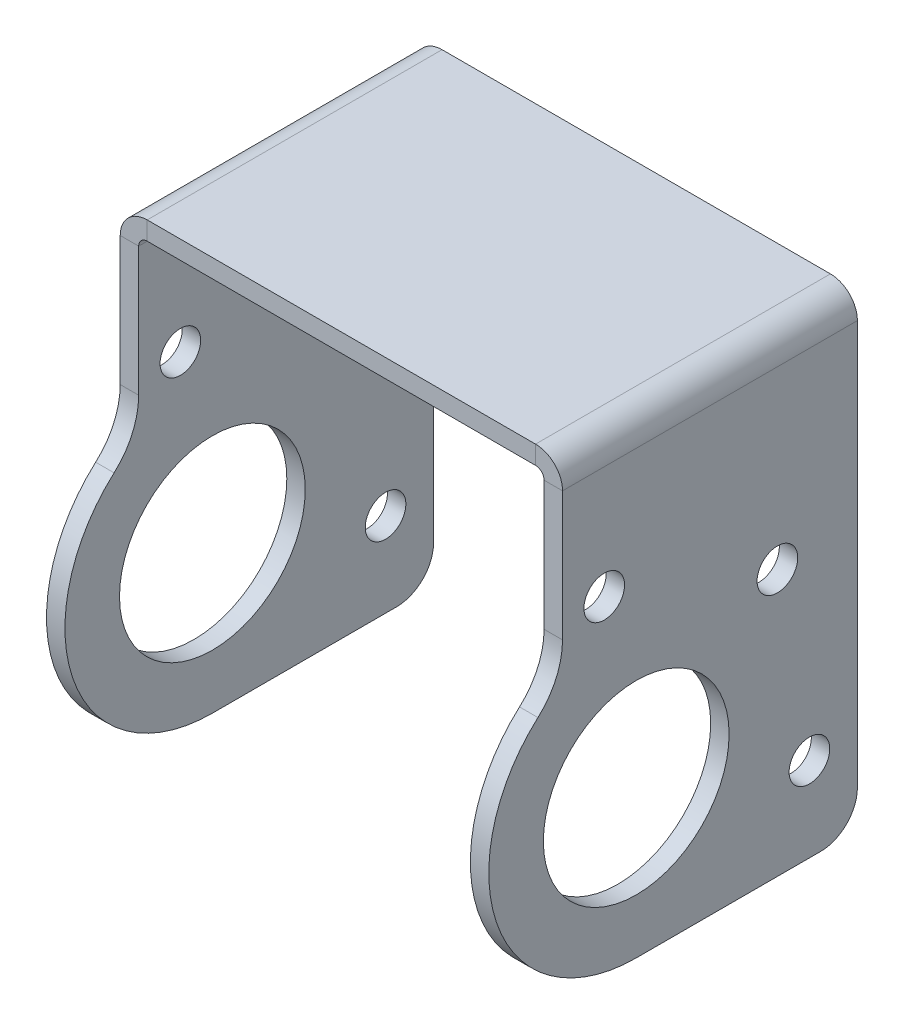
ISO-10303-21;
HEADER;
FILE_DESCRIPTION(('STEP AP214'),'2;1');
FILE_NAME('part.step','',(''),(''),'','','');
FILE_SCHEMA(('AUTOMOTIVE_DESIGN { 1 0 10303 214 1 1 1 1 }'));
ENDSEC;
DATA;
#1=APPLICATION_CONTEXT('core data for automotive mechanical design processes');
#2=APPLICATION_PROTOCOL_DEFINITION('international standard','automotive_design',2000,#1);
#3=PRODUCT_CONTEXT('',#1,'mechanical');
#4=PRODUCT('Part','Part','',(#3));
#5=PRODUCT_RELATED_PRODUCT_CATEGORY('part','',(#4));
#6=PRODUCT_DEFINITION_FORMATION('','',#4);
#7=PRODUCT_DEFINITION_CONTEXT('part definition',#1,'design');
#8=PRODUCT_DEFINITION('design','',#6,#7);
#9=PRODUCT_DEFINITION_SHAPE('','',#8);
#10=(LENGTH_UNIT() NAMED_UNIT(*) SI_UNIT(.MILLI.,.METRE.));
#11=(NAMED_UNIT(*) PLANE_ANGLE_UNIT() SI_UNIT($,.RADIAN.));
#12=(NAMED_UNIT(*) SI_UNIT($,.STERADIAN.) SOLID_ANGLE_UNIT());
#13=UNCERTAINTY_MEASURE_WITH_UNIT(LENGTH_MEASURE(1.E-05),#10,'distance_accuracy_value','');
#14=(GEOMETRIC_REPRESENTATION_CONTEXT(3) GLOBAL_UNCERTAINTY_ASSIGNED_CONTEXT((#13)) GLOBAL_UNIT_ASSIGNED_CONTEXT((#10,
#11,#12)) REPRESENTATION_CONTEXT('',''));
#15=CARTESIAN_POINT('',(0.,0.,0.));
#16=DIRECTION('',(0.,0.,1.));
#17=DIRECTION('',(1.,0.,0.));
#18=AXIS2_PLACEMENT_3D('',#15,#16,#17);
#19=CARTESIAN_POINT('',(-19.05,-1.5875,-12.7));
#20=DIRECTION('',(0.,0.,-1.));
#21=DIRECTION('',(-1.,0.,0.));
#22=AXIS2_PLACEMENT_3D('',#19,#20,#21);
#23=PLANE('',#22);
#24=DIRECTION('',(-1.,0.,0.));
#25=VECTOR('',#24,1.);
#26=CARTESIAN_POINT('',(19.05,-1.5875,-12.7));
#27=LINE('',#26,#25);
#28=CARTESIAN_POINT('',(16.7259,-1.5875,-12.7));
#29=VERTEX_POINT('',#28);
#30=CARTESIAN_POINT('',(-16.7259,-1.5875,-12.7));
#31=VERTEX_POINT('',#30);
#32=EDGE_CURVE('E254',#29,#31,#27,.T.);
#33=ORIENTED_EDGE('',*,*,#32,.T.);
#34=DIRECTION('',(0.,1.,0.));
#35=VECTOR('',#34,1.);
#36=CARTESIAN_POINT('',(-16.7259,-1.5875,-12.7));
#37=LINE('',#36,#35);
#38=CARTESIAN_POINT('',(-16.7259,0.,-12.7));
#39=VERTEX_POINT('',#38);
#40=EDGE_CURVE('E12',#31,#39,#37,.T.);
#41=ORIENTED_EDGE('',*,*,#40,.T.);
#42=DIRECTION('',(-1.,0.,0.));
#43=VECTOR('',#42,1.);
#44=CARTESIAN_POINT('',(-19.05,0.,-12.7));
#45=LINE('',#44,#43);
#46=CARTESIAN_POINT('',(16.7259,0.,-12.7));
#47=VERTEX_POINT('',#46);
#48=EDGE_CURVE('E259',#47,#39,#45,.T.);
#49=ORIENTED_EDGE('',*,*,#48,.F.);
#50=DIRECTION('',(0.,-1.,0.));
#51=VECTOR('',#50,1.);
#52=CARTESIAN_POINT('',(16.7259,-1.5875,-12.7));
#53=LINE('',#52,#51);
#54=EDGE_CURVE('E251',#47,#29,#53,.T.);
#55=ORIENTED_EDGE('',*,*,#54,.T.);
#56=EDGE_LOOP('',(#33,#41,#49,#55));
#57=FACE_BOUND('',#56,.T.);
#58=ADVANCED_FACE('F51',(#57),#23,.T.);
#59=CARTESIAN_POINT('',(0.,-1.5875,12.7));
#60=DIRECTION('',(0.,0.,1.));
#61=DIRECTION('',(1.,0.,0.));
#62=AXIS2_PLACEMENT_3D('',#59,#60,#61);
#63=PLANE('',#62);
#64=DIRECTION('',(1.,0.,0.));
#65=VECTOR('',#64,1.);
#66=CARTESIAN_POINT('',(0.,0.,12.7));
#67=LINE('',#66,#65);
#68=CARTESIAN_POINT('',(-16.7259,0.,12.7));
#69=VERTEX_POINT('',#68);
#70=CARTESIAN_POINT('',(16.7259,0.,12.7));
#71=VERTEX_POINT('',#70);
#72=EDGE_CURVE('E255',#69,#71,#67,.T.);
#73=ORIENTED_EDGE('',*,*,#72,.F.);
#74=DIRECTION('',(0.,-1.,0.));
#75=VECTOR('',#74,1.);
#76=CARTESIAN_POINT('',(-16.7259,-1.5875,12.7));
#77=LINE('',#76,#75);
#78=CARTESIAN_POINT('',(-16.7259,-1.5875,12.7));
#79=VERTEX_POINT('',#78);
#80=EDGE_CURVE('E346',#69,#79,#77,.T.);
#81=ORIENTED_EDGE('',*,*,#80,.T.);
#82=DIRECTION('',(1.,0.,0.));
#83=VECTOR('',#82,1.);
#84=CARTESIAN_POINT('',(19.05,-1.5875,12.7));
#85=LINE('',#84,#83);
#86=CARTESIAN_POINT('',(16.7259,-1.5875,12.7));
#87=VERTEX_POINT('',#86);
#88=EDGE_CURVE('E54',#79,#87,#85,.T.);
#89=ORIENTED_EDGE('',*,*,#88,.T.);
#90=DIRECTION('',(0.,1.,0.));
#91=VECTOR('',#90,1.);
#92=CARTESIAN_POINT('',(16.7259,-1.5875,12.7));
#93=LINE('',#92,#91);
#94=EDGE_CURVE('E256',#87,#71,#93,.T.);
#95=ORIENTED_EDGE('',*,*,#94,.T.);
#96=EDGE_LOOP('',(#73,#81,#89,#95));
#97=FACE_BOUND('',#96,.T.);
#98=ADVANCED_FACE('F368',(#97),#63,.T.);
#99=CARTESIAN_POINT('',(30.2509683428763,-1.5875,19.05));
#100=DIRECTION('',(0.,-1.,0.));
#101=DIRECTION('',(0.,0.,-1.));
#102=AXIS2_PLACEMENT_3D('',#99,#100,#101);
#103=PLANE('',#102);
#104=ORIENTED_EDGE('',*,*,#88,.F.);
#105=DIRECTION('',(0.,0.,-1.));
#106=VECTOR('',#105,1.);
#107=CARTESIAN_POINT('',(-16.7259,-1.5875,19.05));
#108=LINE('',#107,#106);
#109=EDGE_CURVE('E337',#79,#31,#108,.T.);
#110=ORIENTED_EDGE('',*,*,#109,.T.);
#111=ORIENTED_EDGE('',*,*,#32,.F.);
#112=DIRECTION('',(0.,0.,1.));
#113=VECTOR('',#112,1.);
#114=CARTESIAN_POINT('',(16.7259,-1.5875,19.05));
#115=LINE('',#114,#113);
#116=EDGE_CURVE('E260',#29,#87,#115,.T.);
#117=ORIENTED_EDGE('',*,*,#116,.T.);
#118=EDGE_LOOP('',(#104,#110,#111,#117));
#119=FACE_BOUND('',#118,.T.);
#120=ADVANCED_FACE('F371',(#119),#103,.T.);
#121=CARTESIAN_POINT('',(19.05,-13.4453001841658,19.05));
#122=DIRECTION('',(-1.,0.,0.));
#123=DIRECTION('',(0.,0.,-1.));
#124=AXIS2_PLACEMENT_3D('',#121,#122,#123);
#125=PLANE('',#124);
#126=CARTESIAN_POINT('',(19.0499999999999,-27.6443318412894,6.35));
#127=DIRECTION('',(1.,0.,0.));
#128=DIRECTION('',(0.,0.,1.));
#129=AXIS2_PLACEMENT_3D('',#126,#127,#128);
#130=CIRCLE('',#129,7.99999999999999);
#131=CARTESIAN_POINT('',(19.0499999999999,-27.6443318412894,14.35));
#132=VERTEX_POINT('',#131);
#133=EDGE_CURVE('E281',#132,#132,#130,.T.);
#134=ORIENTED_EDGE('',*,*,#133,.F.);
#135=EDGE_LOOP('',(#134));
#136=FACE_BOUND('',#135,.T.);
#137=CARTESIAN_POINT('',(19.05,-12.0105087622206,9.10666482046241));
#138=DIRECTION('',(1.,0.,0.));
#139=DIRECTION('',(0.,0.,1.));
#140=AXIS2_PLACEMENT_3D('',#137,#138,#139);
#141=CIRCLE('',#140,1.75);
#142=CARTESIAN_POINT('',(19.05,-12.0105087622206,10.8566648204624));
#143=VERTEX_POINT('',#142);
#144=EDGE_CURVE('E275',#143,#143,#141,.T.);
#145=ORIENTED_EDGE('',*,*,#144,.F.);
#146=EDGE_LOOP('',(#145));
#147=FACE_BOUND('',#146,.T.);
#148=CARTESIAN_POINT('',(19.05,-17.4400785375157,-5.81095553451387));
#149=DIRECTION('',(1.,0.,0.));
#150=DIRECTION('',(0.,0.,1.));
#151=AXIS2_PLACEMENT_3D('',#148,#149,#150);
#152=CIRCLE('',#151,1.75000000000001);
#153=CARTESIAN_POINT('',(19.05,-17.4400785375157,-4.06095553451386));
#154=VERTEX_POINT('',#153);
#155=EDGE_CURVE('E268',#154,#154,#152,.T.);
#156=ORIENTED_EDGE('',*,*,#155,.F.);
#157=EDGE_LOOP('',(#156));
#158=FACE_BOUND('',#157,.T.);
#159=CARTESIAN_POINT('',(19.0499999999999,-33.0739016165846,-8.56762035497623));
#160=DIRECTION('',(1.,0.,0.));
#161=DIRECTION('',(0.,0.,1.));
#162=AXIS2_PLACEMENT_3D('',#159,#160,#161);
#163=CIRCLE('',#162,1.75);
#164=CARTESIAN_POINT('',(19.0499999999999,-33.0739016165846,-6.81762035497623));
#165=VERTEX_POINT('',#164);
#166=EDGE_CURVE('E269',#165,#165,#163,.T.);
#167=ORIENTED_EDGE('',*,*,#166,.F.);
#168=EDGE_LOOP('',(#167));
#169=FACE_BOUND('',#168,.T.);
#170=DIRECTION('',(0.,1.,0.));
#171=VECTOR('',#170,1.);
#172=CARTESIAN_POINT('',(19.0500000000001,35.8556681587106,-12.7));
#173=LINE('',#172,#171);
#174=CARTESIAN_POINT('',(19.0499999999999,-37.1693318412894,-12.7));
#175=VERTEX_POINT('',#174);
#176=CARTESIAN_POINT('',(19.05,-2.3241,-12.7));
#177=VERTEX_POINT('',#176);
#178=EDGE_CURVE('E74',#175,#177,#173,.T.);
#179=ORIENTED_EDGE('',*,*,#178,.T.);
#180=DIRECTION('',(0.,0.,1.));
#181=VECTOR('',#180,1.);
#182=CARTESIAN_POINT('',(19.05,-2.32410000000001,19.05));
#183=LINE('',#182,#181);
#184=CARTESIAN_POINT('',(19.05,-2.32410000000001,12.7));
#185=VERTEX_POINT('',#184);
#186=EDGE_CURVE('E332',#177,#185,#183,.T.);
#187=ORIENTED_EDGE('',*,*,#186,.T.);
#188=DIRECTION('',(0.,-1.,0.));
#189=VECTOR('',#188,1.);
#190=CARTESIAN_POINT('',(19.0500000000001,16.8056681587106,12.7));
#191=LINE('',#190,#189);
#192=CARTESIAN_POINT('',(19.05,-13.4453001841658,12.7));
#193=VERTEX_POINT('',#192);
#194=EDGE_CURVE('E340',#185,#193,#191,.T.);
#195=ORIENTED_EDGE('',*,*,#194,.T.);
#196=CARTESIAN_POINT('',(19.05,-13.4453001841658,19.05));
#197=DIRECTION('',(-1.,0.,0.));
#198=DIRECTION('',(0.,0.,-1.));
#199=AXIS2_PLACEMENT_3D('',#196,#197,#198);
#200=CIRCLE('',#199,6.35);
#201=CARTESIAN_POINT('',(19.05,-18.1783107365403,14.8166666666667));
#202=VERTEX_POINT('',#201);
#203=EDGE_CURVE('E287',#193,#202,#200,.T.);
#204=ORIENTED_EDGE('',*,*,#203,.T.);
#205=CARTESIAN_POINT('',(19.0499999999999,-27.6443318412894,6.35));
#206=DIRECTION('',(1.,0.,0.));
#207=DIRECTION('',(0.,0.,1.));
#208=AXIS2_PLACEMENT_3D('',#205,#206,#207);
#209=CIRCLE('',#208,12.7);
#210=CARTESIAN_POINT('',(19.0499999999999,-40.3443318412894,6.35));
#211=VERTEX_POINT('',#210);
#212=EDGE_CURVE('E306',#202,#211,#209,.T.);
#213=ORIENTED_EDGE('',*,*,#212,.T.);
#214=DIRECTION('',(0.,0.,-1.));
#215=VECTOR('',#214,1.);
#216=CARTESIAN_POINT('',(19.0499999999999,-40.3443318412894,6.35));
#217=LINE('',#216,#215);
#218=CARTESIAN_POINT('',(19.0499999999999,-40.3443318412894,-9.525));
#219=VERTEX_POINT('',#218);
#220=EDGE_CURVE('E309',#211,#219,#217,.T.);
#221=ORIENTED_EDGE('',*,*,#220,.T.);
#222=CARTESIAN_POINT('',(19.0499999999999,-37.1693318412894,-9.525));
#223=DIRECTION('',(1.,0.,0.));
#224=DIRECTION('',(0.,0.,-1.));
#225=AXIS2_PLACEMENT_3D('',#222,#223,#224);
#226=CIRCLE('',#225,3.175);
#227=EDGE_CURVE('E312',#219,#175,#226,.T.);
#228=ORIENTED_EDGE('',*,*,#227,.T.);
#229=EDGE_LOOP('',(#179,#187,#195,#204,#213,#221,#228));
#230=FACE_BOUND('',#229,.T.);
#231=ADVANCED_FACE('F475',(#136,#147,#158,#169,#230),#125,.F.);
#232=CARTESIAN_POINT('',(17.4625000000001,16.8056681587106,12.7));
#233=DIRECTION('',(0.,0.,1.));
#234=DIRECTION('',(0.,-1.,0.));
#235=AXIS2_PLACEMENT_3D('',#232,#233,#234);
#236=PLANE('',#235);
#237=DIRECTION('',(1.,0.,0.));
#238=VECTOR('',#237,1.);
#239=CARTESIAN_POINT('',(17.4625,-2.3241,12.7));
#240=LINE('',#239,#238);
#241=CARTESIAN_POINT('',(17.4625,-2.3241,12.7));
#242=VERTEX_POINT('',#241);
#243=EDGE_CURVE('E329',#242,#185,#240,.T.);
#244=ORIENTED_EDGE('',*,*,#243,.F.);
#245=DIRECTION('',(0.,-1.,0.));
#246=VECTOR('',#245,1.);
#247=CARTESIAN_POINT('',(17.4625,-2.24433184128942,12.7));
#248=LINE('',#247,#246);
#249=CARTESIAN_POINT('',(17.4625,-13.4453001841658,12.7));
#250=VERTEX_POINT('',#249);
#251=EDGE_CURVE('E294',#242,#250,#248,.T.);
#252=ORIENTED_EDGE('',*,*,#251,.T.);
#253=DIRECTION('',(1.,0.,0.));
#254=VECTOR('',#253,1.);
#255=CARTESIAN_POINT('',(17.4625,-13.4453001841658,12.7));
#256=LINE('',#255,#254);
#257=EDGE_CURVE('E324',#250,#193,#256,.T.);
#258=ORIENTED_EDGE('',*,*,#257,.T.);
#259=ORIENTED_EDGE('',*,*,#194,.F.);
#260=EDGE_LOOP('',(#244,#252,#258,#259));
#261=FACE_BOUND('',#260,.T.);
#262=ADVANCED_FACE('F524',(#261),#236,.T.);
#263=CARTESIAN_POINT('',(17.4625000000001,35.8556681587106,-12.7));
#264=DIRECTION('',(0.,0.,-1.));
#265=DIRECTION('',(0.,1.,0.));
#266=AXIS2_PLACEMENT_3D('',#263,#264,#265);
#267=PLANE('',#266);
#268=DIRECTION('',(-1.,0.,0.));
#269=VECTOR('',#268,1.);
#270=CARTESIAN_POINT('',(17.4625,-2.3241,-12.7));
#271=LINE('',#270,#269);
#272=CARTESIAN_POINT('',(17.4625,-2.3241,-12.7));
#273=VERTEX_POINT('',#272);
#274=EDGE_CURVE('E334',#177,#273,#271,.T.);
#275=ORIENTED_EDGE('',*,*,#274,.F.);
#276=ORIENTED_EDGE('',*,*,#178,.F.);
#277=DIRECTION('',(1.,0.,0.));
#278=VECTOR('',#277,1.);
#279=CARTESIAN_POINT('',(17.4624999999999,-37.1693318412894,-12.7));
#280=LINE('',#279,#278);
#281=CARTESIAN_POINT('',(17.4624999999999,-37.1693318412894,-12.7));
#282=VERTEX_POINT('',#281);
#283=EDGE_CURVE('E314',#282,#175,#280,.T.);
#284=ORIENTED_EDGE('',*,*,#283,.F.);
#285=DIRECTION('',(0.,1.,0.));
#286=VECTOR('',#285,1.);
#287=CARTESIAN_POINT('',(17.4625,-2.24433184128942,-12.7));
#288=LINE('',#287,#286);
#289=EDGE_CURVE('E303',#282,#273,#288,.T.);
#290=ORIENTED_EDGE('',*,*,#289,.T.);
#291=EDGE_LOOP('',(#275,#276,#284,#290));
#292=FACE_BOUND('',#291,.T.);
#293=ADVANCED_FACE('F385',(#292),#267,.T.);
#294=CARTESIAN_POINT('',(17.4624999999999,-37.1693318412894,-9.525));
#295=DIRECTION('',(1.,0.,0.));
#296=DIRECTION('',(0.,0.,1.));
#297=AXIS2_PLACEMENT_3D('',#294,#295,#296);
#298=CYLINDRICAL_SURFACE('',#297,3.175);
#299=ORIENTED_EDGE('',*,*,#227,.F.);
#300=DIRECTION('',(1.,0.,0.));
#301=VECTOR('',#300,1.);
#302=CARTESIAN_POINT('',(17.4624999999999,-40.3443318412894,-9.525));
#303=LINE('',#302,#301);
#304=CARTESIAN_POINT('',(17.4624999999999,-40.3443318412894,-9.525));
#305=VERTEX_POINT('',#304);
#306=EDGE_CURVE('E318',#305,#219,#303,.T.);
#307=ORIENTED_EDGE('',*,*,#306,.F.);
#308=CARTESIAN_POINT('',(17.4624999999999,-37.1693318412894,-9.525));
#309=DIRECTION('',(1.,0.,0.));
#310=DIRECTION('',(0.,0.,-1.));
#311=AXIS2_PLACEMENT_3D('',#308,#309,#310);
#312=CIRCLE('',#311,3.175);
#313=EDGE_CURVE('E300',#305,#282,#312,.T.);
#314=ORIENTED_EDGE('',*,*,#313,.T.);
#315=ORIENTED_EDGE('',*,*,#283,.T.);
#316=EDGE_LOOP('',(#299,#307,#314,#315));
#317=FACE_BOUND('',#316,.T.);
#318=ADVANCED_FACE('F506',(#317),#298,.T.);
#319=CARTESIAN_POINT('',(17.4624999999999,-40.3443318412894,6.35));
#320=DIRECTION('',(0.,-1.,0.));
#321=DIRECTION('',(0.,0.,-1.));
#322=AXIS2_PLACEMENT_3D('',#319,#320,#321);
#323=PLANE('',#322);
#324=ORIENTED_EDGE('',*,*,#220,.F.);
#325=DIRECTION('',(1.,0.,0.));
#326=VECTOR('',#325,1.);
#327=CARTESIAN_POINT('',(17.4624999999999,-40.3443318412894,6.35));
#328=LINE('',#327,#326);
#329=CARTESIAN_POINT('',(17.4624999999999,-40.3443318412894,6.35));
#330=VERTEX_POINT('',#329);
#331=EDGE_CURVE('E320',#330,#211,#328,.T.);
#332=ORIENTED_EDGE('',*,*,#331,.F.);
#333=DIRECTION('',(0.,0.,-1.));
#334=VECTOR('',#333,1.);
#335=CARTESIAN_POINT('',(17.4624999999999,-40.3443318412894,6.35));
#336=LINE('',#335,#334);
#337=EDGE_CURVE('E297',#330,#305,#336,.T.);
#338=ORIENTED_EDGE('',*,*,#337,.T.);
#339=ORIENTED_EDGE('',*,*,#306,.T.);
#340=EDGE_LOOP('',(#324,#332,#338,#339));
#341=FACE_BOUND('',#340,.T.);
#342=ADVANCED_FACE('F509',(#341),#323,.T.);
#343=CARTESIAN_POINT('',(17.4624999999999,-27.6443318412894,6.35));
#344=DIRECTION('',(1.,0.,0.));
#345=DIRECTION('',(0.,0.,1.));
#346=AXIS2_PLACEMENT_3D('',#343,#344,#345);
#347=CYLINDRICAL_SURFACE('',#346,12.7);
#348=ORIENTED_EDGE('',*,*,#212,.F.);
#349=DIRECTION('',(1.,0.,0.));
#350=VECTOR('',#349,1.);
#351=CARTESIAN_POINT('',(17.4625,-18.1783107365403,14.8166666666667));
#352=LINE('',#351,#350);
#353=CARTESIAN_POINT('',(17.4625,-18.1783107365403,14.8166666666667));
#354=VERTEX_POINT('',#353);
#355=EDGE_CURVE('E322',#354,#202,#352,.T.);
#356=ORIENTED_EDGE('',*,*,#355,.F.);
#357=CARTESIAN_POINT('',(17.4624999999999,-27.6443318412894,6.35));
#358=DIRECTION('',(1.,0.,0.));
#359=DIRECTION('',(0.,0.,1.));
#360=AXIS2_PLACEMENT_3D('',#357,#358,#359);
#361=CIRCLE('',#360,12.7);
#362=EDGE_CURVE('E293',#354,#330,#361,.T.);
#363=ORIENTED_EDGE('',*,*,#362,.T.);
#364=ORIENTED_EDGE('',*,*,#331,.T.);
#365=EDGE_LOOP('',(#348,#356,#363,#364));
#366=FACE_BOUND('',#365,.T.);
#367=ADVANCED_FACE('F513',(#366),#347,.T.);
#368=CARTESIAN_POINT('',(17.4625,-13.4453001841658,19.05));
#369=DIRECTION('',(1.,0.,0.));
#370=DIRECTION('',(0.,0.,1.));
#371=AXIS2_PLACEMENT_3D('',#368,#369,#370);
#372=CYLINDRICAL_SURFACE('',#371,6.35);
#373=ORIENTED_EDGE('',*,*,#203,.F.);
#374=ORIENTED_EDGE('',*,*,#257,.F.);
#375=CARTESIAN_POINT('',(17.4625,-13.4453001841658,19.05));
#376=DIRECTION('',(-1.,0.,0.));
#377=DIRECTION('',(0.,0.,-1.));
#378=AXIS2_PLACEMENT_3D('',#375,#376,#377);
#379=CIRCLE('',#378,6.35);
#380=EDGE_CURVE('E290',#250,#354,#379,.T.);
#381=ORIENTED_EDGE('',*,*,#380,.T.);
#382=ORIENTED_EDGE('',*,*,#355,.T.);
#383=EDGE_LOOP('',(#373,#374,#381,#382));
#384=FACE_BOUND('',#383,.T.);
#385=ADVANCED_FACE('F517',(#384),#372,.F.);
#386=CARTESIAN_POINT('',(17.4625,-13.4453001841658,19.05));
#387=DIRECTION('',(-1.,0.,0.));
#388=DIRECTION('',(0.,0.,-1.));
#389=AXIS2_PLACEMENT_3D('',#386,#387,#388);
#390=PLANE('',#389);
#391=DIRECTION('',(0.,0.,1.));
#392=VECTOR('',#391,1.);
#393=CARTESIAN_POINT('',(17.4625,-2.3241,19.05));
#394=LINE('',#393,#392);
#395=EDGE_CURVE('E317',#273,#242,#394,.T.);
#396=ORIENTED_EDGE('',*,*,#395,.F.);
#397=ORIENTED_EDGE('',*,*,#289,.F.);
#398=ORIENTED_EDGE('',*,*,#313,.F.);
#399=ORIENTED_EDGE('',*,*,#337,.F.);
#400=ORIENTED_EDGE('',*,*,#362,.F.);
#401=ORIENTED_EDGE('',*,*,#380,.F.);
#402=ORIENTED_EDGE('',*,*,#251,.F.);
#403=EDGE_LOOP('',(#396,#397,#398,#399,#400,#401,#402));
#404=FACE_BOUND('',#403,.T.);
#405=CARTESIAN_POINT('',(17.4624999999999,-33.0739016165846,-8.56762035497623));
#406=DIRECTION('',(1.,0.,0.));
#407=DIRECTION('',(0.,0.,1.));
#408=AXIS2_PLACEMENT_3D('',#405,#406,#407);
#409=CIRCLE('',#408,1.75);
#410=CARTESIAN_POINT('',(17.4624999999999,-33.0739016165846,-6.81762035497623));
#411=VERTEX_POINT('',#410);
#412=EDGE_CURVE('E265',#411,#411,#409,.T.);
#413=ORIENTED_EDGE('',*,*,#412,.T.);
#414=EDGE_LOOP('',(#413));
#415=FACE_BOUND('',#414,.T.);
#416=CARTESIAN_POINT('',(17.4625,-17.4400785375157,-5.81095553451387));
#417=DIRECTION('',(1.,0.,0.));
#418=DIRECTION('',(0.,0.,1.));
#419=AXIS2_PLACEMENT_3D('',#416,#417,#418);
#420=CIRCLE('',#419,1.75000000000001);
#421=CARTESIAN_POINT('',(17.4625,-17.4400785375157,-4.06095553451386));
#422=VERTEX_POINT('',#421);
#423=EDGE_CURVE('E272',#422,#422,#420,.T.);
#424=ORIENTED_EDGE('',*,*,#423,.T.);
#425=EDGE_LOOP('',(#424));
#426=FACE_BOUND('',#425,.T.);
#427=CARTESIAN_POINT('',(17.4625,-12.0105087622206,9.10666482046241));
#428=DIRECTION('',(1.,0.,0.));
#429=DIRECTION('',(0.,0.,1.));
#430=AXIS2_PLACEMENT_3D('',#427,#428,#429);
#431=CIRCLE('',#430,1.75);
#432=CARTESIAN_POINT('',(17.4625,-12.0105087622206,10.8566648204624));
#433=VERTEX_POINT('',#432);
#434=EDGE_CURVE('E278',#433,#433,#431,.T.);
#435=ORIENTED_EDGE('',*,*,#434,.T.);
#436=EDGE_LOOP('',(#435));
#437=FACE_BOUND('',#436,.T.);
#438=CARTESIAN_POINT('',(17.4624999999999,-27.6443318412894,6.35));
#439=DIRECTION('',(1.,0.,0.));
#440=DIRECTION('',(0.,0.,1.));
#441=AXIS2_PLACEMENT_3D('',#438,#439,#440);
#442=CIRCLE('',#441,7.99999999999999);
#443=CARTESIAN_POINT('',(17.4624999999999,-27.6443318412894,14.35));
#444=VERTEX_POINT('',#443);
#445=EDGE_CURVE('E284',#444,#444,#442,.T.);
#446=ORIENTED_EDGE('',*,*,#445,.T.);
#447=EDGE_LOOP('',(#446));
#448=FACE_BOUND('',#447,.T.);
#449=ADVANCED_FACE('F380',(#404,#415,#426,#437,#448),#390,.T.);
#450=CARTESIAN_POINT('',(17.4624999999999,-27.6443318412894,6.35));
#451=DIRECTION('',(1.,0.,0.));
#452=DIRECTION('',(0.,0.,1.));
#453=AXIS2_PLACEMENT_3D('',#450,#451,#452);
#454=CYLINDRICAL_SURFACE('',#453,7.99999999999999);
#455=ORIENTED_EDGE('',*,*,#445,.F.);
#456=EDGE_LOOP('',(#455));
#457=FACE_BOUND('',#456,.T.);
#458=ORIENTED_EDGE('',*,*,#133,.T.);
#459=EDGE_LOOP('',(#458));
#460=FACE_BOUND('',#459,.T.);
#461=ADVANCED_FACE('F501',(#457,#460),#454,.F.);
#462=CARTESIAN_POINT('',(17.4625,-12.0105087622206,9.10666482046241));
#463=DIRECTION('',(1.,0.,0.));
#464=DIRECTION('',(0.,0.,1.));
#465=AXIS2_PLACEMENT_3D('',#462,#463,#464);
#466=CYLINDRICAL_SURFACE('',#465,1.75);
#467=ORIENTED_EDGE('',*,*,#434,.F.);
#468=EDGE_LOOP('',(#467));
#469=FACE_BOUND('',#468,.T.);
#470=ORIENTED_EDGE('',*,*,#144,.T.);
#471=EDGE_LOOP('',(#470));
#472=FACE_BOUND('',#471,.T.);
#473=ADVANCED_FACE('F492',(#469,#472),#466,.F.);
#474=CARTESIAN_POINT('',(17.4625,-17.4400785375157,-5.81095553451387));
#475=DIRECTION('',(1.,0.,0.));
#476=DIRECTION('',(0.,0.,1.));
#477=AXIS2_PLACEMENT_3D('',#474,#475,#476);
#478=CYLINDRICAL_SURFACE('',#477,1.75000000000001);
#479=ORIENTED_EDGE('',*,*,#423,.F.);
#480=EDGE_LOOP('',(#479));
#481=FACE_BOUND('',#480,.T.);
#482=ORIENTED_EDGE('',*,*,#155,.T.);
#483=EDGE_LOOP('',(#482));
#484=FACE_BOUND('',#483,.T.);
#485=ADVANCED_FACE('F486',(#481,#484),#478,.F.);
#486=CARTESIAN_POINT('',(17.4624999999999,-33.0739016165846,-8.56762035497623));
#487=DIRECTION('',(1.,0.,0.));
#488=DIRECTION('',(0.,0.,1.));
#489=AXIS2_PLACEMENT_3D('',#486,#487,#488);
#490=CYLINDRICAL_SURFACE('',#489,1.75);
#491=ORIENTED_EDGE('',*,*,#412,.F.);
#492=EDGE_LOOP('',(#491));
#493=FACE_BOUND('',#492,.T.);
#494=ORIENTED_EDGE('',*,*,#166,.T.);
#495=EDGE_LOOP('',(#494));
#496=FACE_BOUND('',#495,.T.);
#497=ADVANCED_FACE('F479',(#493,#496),#490,.F.);
#498=CARTESIAN_POINT('',(30.2509683428763,0.,19.05));
#499=DIRECTION('',(0.,-1.,0.));
#500=DIRECTION('',(0.,0.,-1.));
#501=AXIS2_PLACEMENT_3D('',#498,#499,#500);
#502=PLANE('',#501);
#503=DIRECTION('',(0.,0.,-1.));
#504=VECTOR('',#503,1.);
#505=CARTESIAN_POINT('',(-16.7259,0.,19.05));
#506=LINE('',#505,#504);
#507=EDGE_CURVE('E59',#69,#39,#506,.T.);
#508=ORIENTED_EDGE('',*,*,#507,.F.);
#509=ORIENTED_EDGE('',*,*,#72,.T.);
#510=DIRECTION('',(0.,0.,1.));
#511=VECTOR('',#510,1.);
#512=CARTESIAN_POINT('',(16.7259,0.,19.05));
#513=LINE('',#512,#511);
#514=EDGE_CURVE('E246',#47,#71,#513,.T.);
#515=ORIENTED_EDGE('',*,*,#514,.F.);
#516=ORIENTED_EDGE('',*,*,#48,.T.);
#517=EDGE_LOOP('',(#508,#509,#515,#516));
#518=FACE_BOUND('',#517,.T.);
#519=ADVANCED_FACE('F356',(#518),#502,.F.);
#520=CARTESIAN_POINT('',(16.7259,-2.3241,-12.7));
#521=DIRECTION('',(0.,0.,1.));
#522=DIRECTION('',(1.,0.,0.));
#523=AXIS2_PLACEMENT_3D('',#520,#521,#522);
#524=PLANE('',#523);
#525=ORIENTED_EDGE('',*,*,#54,.F.);
#526=CARTESIAN_POINT('',(16.7259,-2.3241,-12.7));
#527=DIRECTION('',(0.,0.,1.));
#528=DIRECTION('',(1.,0.,0.));
#529=AXIS2_PLACEMENT_3D('',#526,#527,#528);
#530=CIRCLE('',#529,2.3241);
#531=EDGE_CURVE('E235',#47,#177,#530,.F.);
#532=ORIENTED_EDGE('',*,*,#531,.T.);
#533=ORIENTED_EDGE('',*,*,#274,.T.);
#534=CARTESIAN_POINT('',(16.7259,-2.3241,-12.7));
#535=DIRECTION('',(0.,0.,-1.));
#536=DIRECTION('',(1.,0.,0.));
#537=AXIS2_PLACEMENT_3D('',#534,#535,#536);
#538=CIRCLE('',#537,0.7366);
#539=EDGE_CURVE('E239',#29,#273,#538,.T.);
#540=ORIENTED_EDGE('',*,*,#539,.F.);
#541=EDGE_LOOP('',(#525,#532,#533,#540));
#542=FACE_BOUND('',#541,.T.);
#543=ADVANCED_FACE('F387',(#542),#524,.F.);
#544=CARTESIAN_POINT('',(16.7259,-2.3241,12.7));
#545=DIRECTION('',(0.,0.,-1.));
#546=DIRECTION('',(-1.,0.,0.));
#547=AXIS2_PLACEMENT_3D('',#544,#545,#546);
#548=PLANE('',#547);
#549=ORIENTED_EDGE('',*,*,#243,.T.);
#550=CARTESIAN_POINT('',(16.7259,-2.3241,12.7));
#551=DIRECTION('',(0.,0.,1.));
#552=DIRECTION('',(1.,0.,0.));
#553=AXIS2_PLACEMENT_3D('',#550,#551,#552);
#554=CIRCLE('',#553,2.3241);
#555=EDGE_CURVE('E243',#185,#71,#554,.T.);
#556=ORIENTED_EDGE('',*,*,#555,.T.);
#557=ORIENTED_EDGE('',*,*,#94,.F.);
#558=CARTESIAN_POINT('',(16.7259,-2.3241,12.7));
#559=DIRECTION('',(0.,0.,1.));
#560=DIRECTION('',(-1.,0.,0.));
#561=AXIS2_PLACEMENT_3D('',#558,#559,#560);
#562=CIRCLE('',#561,0.7366);
#563=EDGE_CURVE('E242',#242,#87,#562,.T.);
#564=ORIENTED_EDGE('',*,*,#563,.F.);
#565=EDGE_LOOP('',(#549,#556,#557,#564));
#566=FACE_BOUND('',#565,.T.);
#567=ADVANCED_FACE('F366',(#566),#548,.F.);
#568=CARTESIAN_POINT('',(16.7259,-2.3241,-25.5628390124114));
#569=DIRECTION('',(0.,0.,1.));
#570=DIRECTION('',(1.,0.,0.));
#571=AXIS2_PLACEMENT_3D('',#568,#569,#570);
#572=CYLINDRICAL_SURFACE('',#571,0.7366);
#573=ORIENTED_EDGE('',*,*,#563,.T.);
#574=ORIENTED_EDGE('',*,*,#116,.F.);
#575=ORIENTED_EDGE('',*,*,#539,.T.);
#576=ORIENTED_EDGE('',*,*,#395,.T.);
#577=EDGE_LOOP('',(#573,#574,#575,#576));
#578=FACE_BOUND('',#577,.T.);
#579=ADVANCED_FACE('F376',(#578),#572,.F.);
#580=CARTESIAN_POINT('',(16.7259,-2.3241,-25.5628390124114));
#581=DIRECTION('',(0.,0.,1.));
#582=DIRECTION('',(1.,0.,0.));
#583=AXIS2_PLACEMENT_3D('',#580,#581,#582);
#584=CYLINDRICAL_SURFACE('',#583,2.3241);
#585=ORIENTED_EDGE('',*,*,#555,.F.);
#586=ORIENTED_EDGE('',*,*,#186,.F.);
#587=ORIENTED_EDGE('',*,*,#531,.F.);
#588=ORIENTED_EDGE('',*,*,#514,.T.);
#589=EDGE_LOOP('',(#585,#586,#587,#588));
#590=FACE_BOUND('',#589,.T.);
#591=ADVANCED_FACE('F361',(#590),#584,.T.);
#592=CARTESIAN_POINT('',(-16.7259,-2.3241,12.7));
#593=DIRECTION('',(0.,0.,-1.));
#594=DIRECTION('',(-1.,0.,0.));
#595=AXIS2_PLACEMENT_3D('',#592,#593,#594);
#596=PLANE('',#595);
#597=ORIENTED_EDGE('',*,*,#80,.F.);
#598=CARTESIAN_POINT('',(-16.7259,-2.3241,12.7));
#599=DIRECTION('',(0.,0.,-1.));
#600=DIRECTION('',(-1.,0.,0.));
#601=AXIS2_PLACEMENT_3D('',#598,#599,#600);
#602=CIRCLE('',#601,2.3241);
#603=CARTESIAN_POINT('',(-19.05,-2.32410000000001,12.7));
#604=VERTEX_POINT('',#603);
#605=EDGE_CURVE('E197',#69,#604,#602,.F.);
#606=ORIENTED_EDGE('',*,*,#605,.T.);
#607=DIRECTION('',(1.,0.,0.));
#608=VECTOR('',#607,1.);
#609=CARTESIAN_POINT('',(-17.4625,-2.3241,12.7));
#610=LINE('',#609,#608);
#611=CARTESIAN_POINT('',(-17.4625,-2.3241,12.7));
#612=VERTEX_POINT('',#611);
#613=EDGE_CURVE('E222',#604,#612,#610,.T.);
#614=ORIENTED_EDGE('',*,*,#613,.T.);
#615=CARTESIAN_POINT('',(-16.7259,-2.3241,12.7));
#616=DIRECTION('',(0.,0.,1.));
#617=DIRECTION('',(-1.,0.,0.));
#618=AXIS2_PLACEMENT_3D('',#615,#616,#617);
#619=CIRCLE('',#618,0.7366);
#620=EDGE_CURVE('E228',#79,#612,#619,.T.);
#621=ORIENTED_EDGE('',*,*,#620,.F.);
#622=EDGE_LOOP('',(#597,#606,#614,#621));
#623=FACE_BOUND('',#622,.T.);
#624=ADVANCED_FACE('F409',(#623),#596,.F.);
#625=CARTESIAN_POINT('',(-16.7259,-2.3241,-12.7));
#626=DIRECTION('',(0.,0.,1.));
#627=DIRECTION('',(1.,0.,0.));
#628=AXIS2_PLACEMENT_3D('',#625,#626,#627);
#629=PLANE('',#628);
#630=DIRECTION('',(-1.,0.,0.));
#631=VECTOR('',#630,1.);
#632=CARTESIAN_POINT('',(-17.4625,-2.3241,-12.7));
#633=LINE('',#632,#631);
#634=CARTESIAN_POINT('',(-17.4625,-2.3241,-12.7));
#635=VERTEX_POINT('',#634);
#636=CARTESIAN_POINT('',(-19.05,-2.32410000000001,-12.7));
#637=VERTEX_POINT('',#636);
#638=EDGE_CURVE('E185',#635,#637,#633,.T.);
#639=ORIENTED_EDGE('',*,*,#638,.T.);
#640=CARTESIAN_POINT('',(-16.7259,-2.3241,-12.7));
#641=DIRECTION('',(0.,0.,-1.));
#642=DIRECTION('',(-1.,0.,0.));
#643=AXIS2_PLACEMENT_3D('',#640,#641,#642);
#644=CIRCLE('',#643,2.3241);
#645=EDGE_CURVE('E232',#637,#39,#644,.T.);
#646=ORIENTED_EDGE('',*,*,#645,.T.);
#647=ORIENTED_EDGE('',*,*,#40,.F.);
#648=CARTESIAN_POINT('',(-16.7259,-2.3241,-12.7));
#649=DIRECTION('',(0.,0.,-1.));
#650=DIRECTION('',(1.,0.,0.));
#651=AXIS2_PLACEMENT_3D('',#648,#649,#650);
#652=CIRCLE('',#651,0.7366);
#653=EDGE_CURVE('E231',#635,#31,#652,.T.);
#654=ORIENTED_EDGE('',*,*,#653,.F.);
#655=EDGE_LOOP('',(#639,#646,#647,#654));
#656=FACE_BOUND('',#655,.T.);
#657=ADVANCED_FACE('F391',(#656),#629,.F.);
#658=CARTESIAN_POINT('',(-16.7259,-2.3241,25.5628390124114));
#659=DIRECTION('',(0.,0.,-1.));
#660=DIRECTION('',(-1.,0.,0.));
#661=AXIS2_PLACEMENT_3D('',#658,#659,#660);
#662=CYLINDRICAL_SURFACE('',#661,0.7366);
#663=ORIENTED_EDGE('',*,*,#653,.T.);
#664=ORIENTED_EDGE('',*,*,#109,.F.);
#665=ORIENTED_EDGE('',*,*,#620,.T.);
#666=DIRECTION('',(0.,0.,-1.));
#667=VECTOR('',#666,1.);
#668=CARTESIAN_POINT('',(-17.4625,-2.3241,19.05));
#669=LINE('',#668,#667);
#670=EDGE_CURVE('E226',#612,#635,#669,.T.);
#671=ORIENTED_EDGE('',*,*,#670,.T.);
#672=EDGE_LOOP('',(#663,#664,#665,#671));
#673=FACE_BOUND('',#672,.T.);
#674=ADVANCED_FACE('F393',(#673),#662,.F.);
#675=CARTESIAN_POINT('',(-16.7259,-2.3241,25.5628390124114));
#676=DIRECTION('',(0.,0.,-1.));
#677=DIRECTION('',(-1.,0.,0.));
#678=AXIS2_PLACEMENT_3D('',#675,#676,#677);
#679=CYLINDRICAL_SURFACE('',#678,2.3241);
#680=ORIENTED_EDGE('',*,*,#645,.F.);
#681=DIRECTION('',(0.,0.,-1.));
#682=VECTOR('',#681,1.);
#683=CARTESIAN_POINT('',(-19.05,-2.32410000000001,19.05));
#684=LINE('',#683,#682);
#685=EDGE_CURVE('E412',#604,#637,#684,.T.);
#686=ORIENTED_EDGE('',*,*,#685,.F.);
#687=ORIENTED_EDGE('',*,*,#605,.F.);
#688=ORIENTED_EDGE('',*,*,#507,.T.);
#689=EDGE_LOOP('',(#680,#686,#687,#688));
#690=FACE_BOUND('',#689,.T.);
#691=ADVANCED_FACE('F410',(#690),#679,.T.);
#692=CARTESIAN_POINT('',(-17.4624999999999,-27.6443318412894,6.35));
#693=DIRECTION('',(-1.,0.,0.));
#694=DIRECTION('',(0.,0.,1.));
#695=AXIS2_PLACEMENT_3D('',#692,#693,#694);
#696=CYLINDRICAL_SURFACE('',#695,7.99999999999999);
#697=CARTESIAN_POINT('',(-17.4624999999999,-27.6443318412894,6.35));
#698=DIRECTION('',(-1.,0.,0.));
#699=DIRECTION('',(0.,0.,-1.));
#700=AXIS2_PLACEMENT_3D('',#697,#698,#699);
#701=CIRCLE('',#700,7.99999999999999);
#702=CARTESIAN_POINT('',(-17.4624999999999,-27.6443318412894,-1.64999999999999));
#703=VERTEX_POINT('',#702);
#704=EDGE_CURVE('E406',#703,#703,#701,.T.);
#705=ORIENTED_EDGE('',*,*,#704,.F.);
#706=EDGE_LOOP('',(#705));
#707=FACE_BOUND('',#706,.T.);
#708=CARTESIAN_POINT('',(-19.0499999999999,-27.6443318412894,6.35));
#709=DIRECTION('',(-1.,0.,0.));
#710=DIRECTION('',(0.,0.,-1.));
#711=AXIS2_PLACEMENT_3D('',#708,#709,#710);
#712=CIRCLE('',#711,7.99999999999999);
#713=CARTESIAN_POINT('',(-19.0499999999999,-27.6443318412894,-1.64999999999999));
#714=VERTEX_POINT('',#713);
#715=EDGE_CURVE('E219',#714,#714,#712,.T.);
#716=ORIENTED_EDGE('',*,*,#715,.T.);
#717=EDGE_LOOP('',(#716));
#718=FACE_BOUND('',#717,.T.);
#719=ADVANCED_FACE('F666',(#707,#718),#696,.F.);
#720=CARTESIAN_POINT('',(-17.4625,-12.0105087622206,9.10666482046242));
#721=DIRECTION('',(-1.,0.,0.));
#722=DIRECTION('',(0.,0.,1.));
#723=AXIS2_PLACEMENT_3D('',#720,#721,#722);
#724=CYLINDRICAL_SURFACE('',#723,1.75);
#725=CARTESIAN_POINT('',(-17.4625,-12.0105087622206,9.10666482046242));
#726=DIRECTION('',(-1.,0.,0.));
#727=DIRECTION('',(0.,0.,-1.));
#728=AXIS2_PLACEMENT_3D('',#725,#726,#727);
#729=CIRCLE('',#728,1.75);
#730=CARTESIAN_POINT('',(-17.4625,-12.0105087622206,7.35666482046241));
#731=VERTEX_POINT('',#730);
#732=EDGE_CURVE('E422',#731,#731,#729,.T.);
#733=ORIENTED_EDGE('',*,*,#732,.F.);
#734=EDGE_LOOP('',(#733));
#735=FACE_BOUND('',#734,.T.);
#736=CARTESIAN_POINT('',(-19.05,-12.0105087622206,9.10666482046242));
#737=DIRECTION('',(-1.,0.,0.));
#738=DIRECTION('',(0.,0.,-1.));
#739=AXIS2_PLACEMENT_3D('',#736,#737,#738);
#740=CIRCLE('',#739,1.75);
#741=CARTESIAN_POINT('',(-19.05,-12.0105087622206,7.35666482046241));
#742=VERTEX_POINT('',#741);
#743=EDGE_CURVE('E216',#742,#742,#740,.T.);
#744=ORIENTED_EDGE('',*,*,#743,.T.);
#745=EDGE_LOOP('',(#744));
#746=FACE_BOUND('',#745,.T.);
#747=ADVANCED_FACE('F673',(#735,#746),#724,.F.);
#748=CARTESIAN_POINT('',(-17.4625,-17.4400785375157,-5.81095553451387));
#749=DIRECTION('',(-1.,0.,0.));
#750=DIRECTION('',(0.,0.,1.));
#751=AXIS2_PLACEMENT_3D('',#748,#749,#750);
#752=CYLINDRICAL_SURFACE('',#751,1.75000000000001);
#753=CARTESIAN_POINT('',(-17.4625,-17.4400785375157,-5.81095553451387));
#754=DIRECTION('',(-1.,0.,0.));
#755=DIRECTION('',(0.,0.,-1.));
#756=AXIS2_PLACEMENT_3D('',#753,#754,#755);
#757=CIRCLE('',#756,1.75000000000001);
#758=CARTESIAN_POINT('',(-17.4625,-17.4400785375157,-7.56095553451388));
#759=VERTEX_POINT('',#758);
#760=EDGE_CURVE('E425',#759,#759,#757,.T.);
#761=ORIENTED_EDGE('',*,*,#760,.F.);
#762=EDGE_LOOP('',(#761));
#763=FACE_BOUND('',#762,.T.);
#764=CARTESIAN_POINT('',(-19.05,-17.4400785375157,-5.81095553451387));
#765=DIRECTION('',(-1.,0.,0.));
#766=DIRECTION('',(0.,0.,-1.));
#767=AXIS2_PLACEMENT_3D('',#764,#765,#766);
#768=CIRCLE('',#767,1.75000000000001);
#769=CARTESIAN_POINT('',(-19.05,-17.4400785375157,-7.56095553451388));
#770=VERTEX_POINT('',#769);
#771=EDGE_CURVE('E210',#770,#770,#768,.T.);
#772=ORIENTED_EDGE('',*,*,#771,.T.);
#773=EDGE_LOOP('',(#772));
#774=FACE_BOUND('',#773,.T.);
#775=ADVANCED_FACE('F682',(#763,#774),#752,.F.);
#776=CARTESIAN_POINT('',(-17.4624999999999,-33.0739016165846,-8.56762035497622));
#777=DIRECTION('',(-1.,0.,0.));
#778=DIRECTION('',(0.,0.,1.));
#779=AXIS2_PLACEMENT_3D('',#776,#777,#778);
#780=CYLINDRICAL_SURFACE('',#779,1.75);
#781=CARTESIAN_POINT('',(-17.4624999999999,-33.0739016165846,-8.56762035497622));
#782=DIRECTION('',(-1.,0.,0.));
#783=DIRECTION('',(0.,0.,-1.));
#784=AXIS2_PLACEMENT_3D('',#781,#782,#783);
#785=CIRCLE('',#784,1.75);
#786=CARTESIAN_POINT('',(-17.4624999999999,-33.0739016165846,-10.3176203549762));
#787=VERTEX_POINT('',#786);
#788=EDGE_CURVE('E428',#787,#787,#785,.T.);
#789=ORIENTED_EDGE('',*,*,#788,.F.);
#790=EDGE_LOOP('',(#789));
#791=FACE_BOUND('',#790,.T.);
#792=CARTESIAN_POINT('',(-19.0499999999999,-33.0739016165846,-8.56762035497622));
#793=DIRECTION('',(-1.,0.,0.));
#794=DIRECTION('',(0.,0.,-1.));
#795=AXIS2_PLACEMENT_3D('',#792,#793,#794);
#796=CIRCLE('',#795,1.75);
#797=CARTESIAN_POINT('',(-19.0499999999999,-33.0739016165846,-10.3176203549762));
#798=VERTEX_POINT('',#797);
#799=EDGE_CURVE('E206',#798,#798,#796,.T.);
#800=ORIENTED_EDGE('',*,*,#799,.T.);
#801=EDGE_LOOP('',(#800));
#802=FACE_BOUND('',#801,.T.);
#803=ADVANCED_FACE('F691',(#791,#802),#780,.F.);
#804=CARTESIAN_POINT('',(-17.4624999999999,-37.1693318412894,-9.52499999999999));
#805=DIRECTION('',(-1.,0.,0.));
#806=DIRECTION('',(0.,0.,1.));
#807=AXIS2_PLACEMENT_3D('',#804,#805,#806);
#808=CYLINDRICAL_SURFACE('',#807,3.175);
#809=CARTESIAN_POINT('',(-19.0499999999999,-37.1693318412894,-9.52499999999999));
#810=DIRECTION('',(-1.,0.,0.));
#811=DIRECTION('',(0.,0.,1.));
#812=AXIS2_PLACEMENT_3D('',#809,#810,#811);
#813=CIRCLE('',#812,3.175);
#814=CARTESIAN_POINT('',(-19.0499999999999,-37.1693318412894,-12.7));
#815=VERTEX_POINT('',#814);
#816=CARTESIAN_POINT('',(-19.0499999999999,-40.3443318412894,-9.52499999999999));
#817=VERTEX_POINT('',#816);
#818=EDGE_CURVE('E196',#815,#817,#813,.T.);
#819=ORIENTED_EDGE('',*,*,#818,.F.);
#820=DIRECTION('',(-1.,0.,0.));
#821=VECTOR('',#820,1.);
#822=CARTESIAN_POINT('',(-17.4624999999999,-37.1693318412894,-12.7));
#823=LINE('',#822,#821);
#824=CARTESIAN_POINT('',(-17.4624999999999,-37.1693318412894,-12.7));
#825=VERTEX_POINT('',#824);
#826=EDGE_CURVE('E182',#825,#815,#823,.T.);
#827=ORIENTED_EDGE('',*,*,#826,.F.);
#828=CARTESIAN_POINT('',(-17.4624999999999,-37.1693318412894,-9.52499999999999));
#829=DIRECTION('',(-1.,0.,0.));
#830=DIRECTION('',(0.,0.,1.));
#831=AXIS2_PLACEMENT_3D('',#828,#829,#830);
#832=CIRCLE('',#831,3.175);
#833=CARTESIAN_POINT('',(-17.4624999999999,-40.3443318412894,-9.52499999999999));
#834=VERTEX_POINT('',#833);
#835=EDGE_CURVE('E194',#825,#834,#832,.T.);
#836=ORIENTED_EDGE('',*,*,#835,.T.);
#837=DIRECTION('',(-1.,0.,0.));
#838=VECTOR('',#837,1.);
#839=CARTESIAN_POINT('',(-17.4624999999999,-40.3443318412894,-9.52499999999999));
#840=LINE('',#839,#838);
#841=EDGE_CURVE('E205',#834,#817,#840,.T.);
#842=ORIENTED_EDGE('',*,*,#841,.T.);
#843=EDGE_LOOP('',(#819,#827,#836,#842));
#844=FACE_BOUND('',#843,.T.);
#845=ADVANCED_FACE('F193',(#844),#808,.T.);
#846=CARTESIAN_POINT('',(-17.4624999999999,-40.3443318412894,6.35));
#847=DIRECTION('',(0.,-1.,0.));
#848=DIRECTION('',(0.,0.,1.));
#849=AXIS2_PLACEMENT_3D('',#846,#847,#848);
#850=PLANE('',#849);
#851=DIRECTION('',(0.,0.,1.));
#852=VECTOR('',#851,1.);
#853=CARTESIAN_POINT('',(-19.0499999999999,-40.3443318412894,6.35));
#854=LINE('',#853,#852);
#855=CARTESIAN_POINT('',(-19.0499999999999,-40.3443318412894,6.35));
#856=VERTEX_POINT('',#855);
#857=EDGE_CURVE('E445',#817,#856,#854,.T.);
#858=ORIENTED_EDGE('',*,*,#857,.F.);
#859=ORIENTED_EDGE('',*,*,#841,.F.);
#860=DIRECTION('',(0.,0.,1.));
#861=VECTOR('',#860,1.);
#862=CARTESIAN_POINT('',(-17.4624999999999,-40.3443318412894,6.35));
#863=LINE('',#862,#861);
#864=CARTESIAN_POINT('',(-17.4624999999999,-40.3443318412894,6.35));
#865=VERTEX_POINT('',#864);
#866=EDGE_CURVE('E204',#834,#865,#863,.T.);
#867=ORIENTED_EDGE('',*,*,#866,.T.);
#868=DIRECTION('',(-1.,0.,0.));
#869=VECTOR('',#868,1.);
#870=CARTESIAN_POINT('',(-17.4624999999999,-40.3443318412894,6.35));
#871=LINE('',#870,#869);
#872=EDGE_CURVE('E439',#865,#856,#871,.T.);
#873=ORIENTED_EDGE('',*,*,#872,.T.);
#874=EDGE_LOOP('',(#858,#859,#867,#873));
#875=FACE_BOUND('',#874,.T.);
#876=ADVANCED_FACE('F442',(#875),#850,.T.);
#877=CARTESIAN_POINT('',(-17.4624999999999,-27.6443318412894,6.35));
#878=DIRECTION('',(-1.,0.,0.));
#879=DIRECTION('',(0.,0.,1.));
#880=AXIS2_PLACEMENT_3D('',#877,#878,#879);
#881=CYLINDRICAL_SURFACE('',#880,12.7);
#882=CARTESIAN_POINT('',(-19.0499999999999,-27.6443318412894,6.35));
#883=DIRECTION('',(-1.,0.,0.));
#884=DIRECTION('',(0.,0.,-1.));
#885=AXIS2_PLACEMENT_3D('',#882,#883,#884);
#886=CIRCLE('',#885,12.7);
#887=CARTESIAN_POINT('',(-19.0499999999999,-18.1783107365403,14.8166666666667));
#888=VERTEX_POINT('',#887);
#889=EDGE_CURVE('E447',#856,#888,#886,.T.);
#890=ORIENTED_EDGE('',*,*,#889,.F.);
#891=ORIENTED_EDGE('',*,*,#872,.F.);
#892=CARTESIAN_POINT('',(-17.4624999999999,-27.6443318412894,6.35));
#893=DIRECTION('',(-1.,0.,0.));
#894=DIRECTION('',(0.,0.,-1.));
#895=AXIS2_PLACEMENT_3D('',#892,#893,#894);
#896=CIRCLE('',#895,12.7);
#897=CARTESIAN_POINT('',(-17.4624999999999,-18.1783107365403,14.8166666666667));
#898=VERTEX_POINT('',#897);
#899=EDGE_CURVE('E436',#865,#898,#896,.T.);
#900=ORIENTED_EDGE('',*,*,#899,.T.);
#901=DIRECTION('',(-1.,0.,0.));
#902=VECTOR('',#901,1.);
#903=CARTESIAN_POINT('',(-17.4624999999999,-18.1783107365403,14.8166666666667));
#904=LINE('',#903,#902);
#905=EDGE_CURVE('E434',#898,#888,#904,.T.);
#906=ORIENTED_EDGE('',*,*,#905,.T.);
#907=EDGE_LOOP('',(#890,#891,#900,#906));
#908=FACE_BOUND('',#907,.T.);
#909=ADVANCED_FACE('F457',(#908),#881,.T.);
#910=CARTESIAN_POINT('',(-17.4625,-13.4453001841658,19.05));
#911=DIRECTION('',(-1.,0.,0.));
#912=DIRECTION('',(0.,0.,1.));
#913=AXIS2_PLACEMENT_3D('',#910,#911,#912);
#914=CYLINDRICAL_SURFACE('',#913,6.35);
#915=CARTESIAN_POINT('',(-19.05,-13.4453001841658,19.05));
#916=DIRECTION('',(1.,0.,0.));
#917=DIRECTION('',(0.,0.,1.));
#918=AXIS2_PLACEMENT_3D('',#915,#916,#917);
#919=CIRCLE('',#918,6.35);
#920=CARTESIAN_POINT('',(-19.05,-13.4453001841658,12.7));
#921=VERTEX_POINT('',#920);
#922=EDGE_CURVE('E189',#888,#921,#919,.T.);
#923=ORIENTED_EDGE('',*,*,#922,.F.);
#924=ORIENTED_EDGE('',*,*,#905,.F.);
#925=CARTESIAN_POINT('',(-17.4625,-13.4453001841658,19.05));
#926=DIRECTION('',(1.,0.,0.));
#927=DIRECTION('',(0.,0.,1.));
#928=AXIS2_PLACEMENT_3D('',#925,#926,#927);
#929=CIRCLE('',#928,6.35);
#930=CARTESIAN_POINT('',(-17.4625,-13.4453001841658,12.7));
#931=VERTEX_POINT('',#930);
#932=EDGE_CURVE('E432',#898,#931,#929,.T.);
#933=ORIENTED_EDGE('',*,*,#932,.T.);
#934=DIRECTION('',(-1.,0.,0.));
#935=VECTOR('',#934,1.);
#936=CARTESIAN_POINT('',(-17.4625,-13.4453001841658,12.7));
#937=LINE('',#936,#935);
#938=EDGE_CURVE('E403',#931,#921,#937,.T.);
#939=ORIENTED_EDGE('',*,*,#938,.T.);
#940=EDGE_LOOP('',(#923,#924,#933,#939));
#941=FACE_BOUND('',#940,.T.);
#942=ADVANCED_FACE('F455',(#941),#914,.F.);
#943=CARTESIAN_POINT('',(-17.4625000000002,47.0566365015869,19.05));
#944=DIRECTION('',(1.,0.,0.));
#945=DIRECTION('',(0.,0.,-1.));
#946=AXIS2_PLACEMENT_3D('',#943,#944,#945);
#947=PLANE('',#946);
#948=ORIENTED_EDGE('',*,*,#670,.F.);
#949=DIRECTION('',(0.,1.,0.));
#950=VECTOR('',#949,1.);
#951=CARTESIAN_POINT('',(-17.4625000000001,35.8556681587106,12.7));
#952=LINE('',#951,#950);
#953=EDGE_CURVE('E396',#931,#612,#952,.T.);
#954=ORIENTED_EDGE('',*,*,#953,.F.);
#955=ORIENTED_EDGE('',*,*,#932,.F.);
#956=ORIENTED_EDGE('',*,*,#899,.F.);
#957=ORIENTED_EDGE('',*,*,#866,.F.);
#958=ORIENTED_EDGE('',*,*,#835,.F.);
#959=DIRECTION('',(0.,-1.,0.));
#960=VECTOR('',#959,1.);
#961=CARTESIAN_POINT('',(-17.4625000000001,35.8556681587106,-12.7));
#962=LINE('',#961,#960);
#963=EDGE_CURVE('E179',#635,#825,#962,.T.);
#964=ORIENTED_EDGE('',*,*,#963,.F.);
#965=EDGE_LOOP('',(#948,#954,#955,#956,#957,#958,#964));
#966=FACE_BOUND('',#965,.T.);
#967=ORIENTED_EDGE('',*,*,#788,.T.);
#968=EDGE_LOOP('',(#967));
#969=FACE_BOUND('',#968,.T.);
#970=ORIENTED_EDGE('',*,*,#760,.T.);
#971=EDGE_LOOP('',(#970));
#972=FACE_BOUND('',#971,.T.);
#973=ORIENTED_EDGE('',*,*,#732,.T.);
#974=EDGE_LOOP('',(#973));
#975=FACE_BOUND('',#974,.T.);
#976=ORIENTED_EDGE('',*,*,#704,.T.);
#977=EDGE_LOOP('',(#976));
#978=FACE_BOUND('',#977,.T.);
#979=ADVANCED_FACE('F200',(#966,#969,#972,#975,#978),#947,.T.);
#980=CARTESIAN_POINT('',(-17.4625000000001,16.8056681587106,12.7));
#981=DIRECTION('',(0.,0.,1.));
#982=DIRECTION('',(0.,1.,0.));
#983=AXIS2_PLACEMENT_3D('',#980,#981,#982);
#984=PLANE('',#983);
#985=ORIENTED_EDGE('',*,*,#613,.F.);
#986=DIRECTION('',(0.,1.,0.));
#987=VECTOR('',#986,1.);
#988=CARTESIAN_POINT('',(-19.0500000000001,16.8056681587106,12.7));
#989=LINE('',#988,#987);
#990=EDGE_CURVE('E405',#921,#604,#989,.T.);
#991=ORIENTED_EDGE('',*,*,#990,.F.);
#992=ORIENTED_EDGE('',*,*,#938,.F.);
#993=ORIENTED_EDGE('',*,*,#953,.T.);
#994=EDGE_LOOP('',(#985,#991,#992,#993));
#995=FACE_BOUND('',#994,.T.);
#996=ADVANCED_FACE('F400',(#995),#984,.T.);
#997=CARTESIAN_POINT('',(-19.0500000000002,47.0566365015869,19.05));
#998=DIRECTION('',(1.,0.,0.));
#999=DIRECTION('',(0.,0.,-1.));
#1000=AXIS2_PLACEMENT_3D('',#997,#998,#999);
#1001=PLANE('',#1000);
#1002=ORIENTED_EDGE('',*,*,#715,.F.);
#1003=EDGE_LOOP('',(#1002));
#1004=FACE_BOUND('',#1003,.T.);
#1005=ORIENTED_EDGE('',*,*,#743,.F.);
#1006=EDGE_LOOP('',(#1005));
#1007=FACE_BOUND('',#1006,.T.);
#1008=ORIENTED_EDGE('',*,*,#771,.F.);
#1009=EDGE_LOOP('',(#1008));
#1010=FACE_BOUND('',#1009,.T.);
#1011=ORIENTED_EDGE('',*,*,#799,.F.);
#1012=EDGE_LOOP('',(#1011));
#1013=FACE_BOUND('',#1012,.T.);
#1014=ORIENTED_EDGE('',*,*,#990,.T.);
#1015=ORIENTED_EDGE('',*,*,#685,.T.);
#1016=DIRECTION('',(0.,-1.,0.));
#1017=VECTOR('',#1016,1.);
#1018=CARTESIAN_POINT('',(-19.05,-2.24433184128942,-12.7));
#1019=LINE('',#1018,#1017);
#1020=EDGE_CURVE('E414',#637,#815,#1019,.T.);
#1021=ORIENTED_EDGE('',*,*,#1020,.T.);
#1022=ORIENTED_EDGE('',*,*,#818,.T.);
#1023=ORIENTED_EDGE('',*,*,#857,.T.);
#1024=ORIENTED_EDGE('',*,*,#889,.T.);
#1025=ORIENTED_EDGE('',*,*,#922,.T.);
#1026=EDGE_LOOP('',(#1014,#1015,#1021,#1022,#1023,#1024,#1025));
#1027=FACE_BOUND('',#1026,.T.);
#1028=ADVANCED_FACE('F449',(#1004,#1007,#1010,#1013,#1027),#1001,.F.);
#1029=CARTESIAN_POINT('',(-17.4625,-2.24433184128942,-12.7));
#1030=DIRECTION('',(0.,0.,-1.));
#1031=DIRECTION('',(0.,-1.,0.));
#1032=AXIS2_PLACEMENT_3D('',#1029,#1030,#1031);
#1033=PLANE('',#1032);
#1034=ORIENTED_EDGE('',*,*,#638,.F.);
#1035=ORIENTED_EDGE('',*,*,#963,.T.);
#1036=ORIENTED_EDGE('',*,*,#826,.T.);
#1037=ORIENTED_EDGE('',*,*,#1020,.F.);
#1038=EDGE_LOOP('',(#1034,#1035,#1036,#1037));
#1039=FACE_BOUND('',#1038,.T.);
#1040=ADVANCED_FACE('F181',(#1039),#1033,.T.);
#1041=CLOSED_SHELL('',(#58,#98,#120,#231,#262,#293,#318,#342,#367,#385,#449,#461,#473,#485,#497,
#519,#543,#567,#579,#591,#624,#657,#674,#691,#719,#747,#775,#803,#845,#876,#909,#942,#979,#996,
#1028,#1040));
#1042=MANIFOLD_SOLID_BREP('B2',#1041);
#1043=ADVANCED_BREP_SHAPE_REPRESENTATION('',(#18,#1042),#14);
#1044=SHAPE_DEFINITION_REPRESENTATION(#9,#1043);
ENDSEC;
END-ISO-10303-21;
